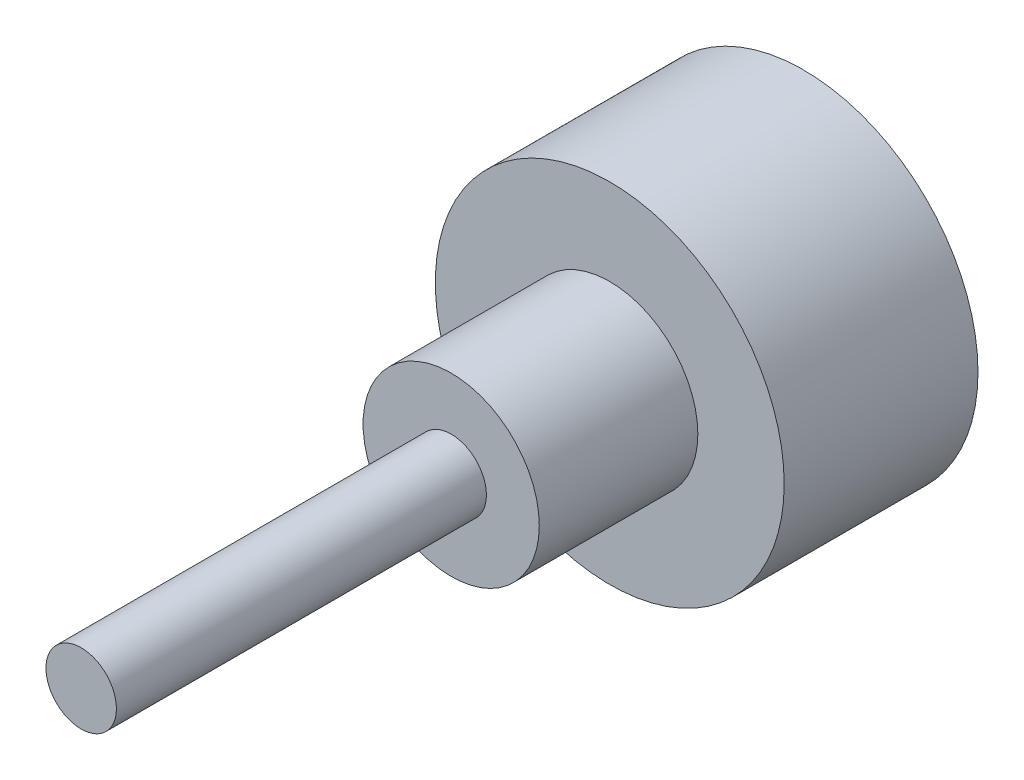
ISO-10303-21;
HEADER;
FILE_DESCRIPTION(('STEP AP214'),'2;1');
FILE_NAME('part.step','',(''),(''),'','','');
FILE_SCHEMA(('AUTOMOTIVE_DESIGN { 1 0 10303 214 1 1 1 1 }'));
ENDSEC;
DATA;
#1=APPLICATION_CONTEXT('core data for automotive mechanical design processes');
#2=APPLICATION_PROTOCOL_DEFINITION('international standard','automotive_design',2000,#1);
#3=PRODUCT_CONTEXT('',#1,'mechanical');
#4=PRODUCT('Part','Part','',(#3));
#5=PRODUCT_RELATED_PRODUCT_CATEGORY('part','',(#4));
#6=PRODUCT_DEFINITION_FORMATION('','',#4);
#7=PRODUCT_DEFINITION_CONTEXT('part definition',#1,'design');
#8=PRODUCT_DEFINITION('design','',#6,#7);
#9=PRODUCT_DEFINITION_SHAPE('','',#8);
#10=(LENGTH_UNIT() NAMED_UNIT(*) SI_UNIT(.MILLI.,.METRE.));
#11=(NAMED_UNIT(*) PLANE_ANGLE_UNIT() SI_UNIT($,.RADIAN.));
#12=(NAMED_UNIT(*) SI_UNIT($,.STERADIAN.) SOLID_ANGLE_UNIT());
#13=UNCERTAINTY_MEASURE_WITH_UNIT(LENGTH_MEASURE(1.E-05),#10,'distance_accuracy_value','');
#14=(GEOMETRIC_REPRESENTATION_CONTEXT(3) GLOBAL_UNCERTAINTY_ASSIGNED_CONTEXT((#13)) GLOBAL_UNIT_ASSIGNED_CONTEXT((#10,
#11,#12)) REPRESENTATION_CONTEXT('',''));
#15=CARTESIAN_POINT('',(0.,0.,0.));
#16=DIRECTION('',(0.,0.,1.));
#17=DIRECTION('',(1.,0.,0.));
#18=AXIS2_PLACEMENT_3D('',#15,#16,#17);
#19=CARTESIAN_POINT('',(0.,0.,0.));
#20=DIRECTION('',(0.,0.,1.));
#21=DIRECTION('',(1.,0.,0.));
#22=AXIS2_PLACEMENT_3D('',#19,#20,#21);
#23=PLANE('',#22);
#24=CARTESIAN_POINT('',(0.,0.,0.));
#25=DIRECTION('',(0.,0.,1.));
#26=DIRECTION('',(1.,0.,0.));
#27=AXIS2_PLACEMENT_3D('',#24,#25,#26);
#28=CIRCLE('',#27,9.9);
#29=CARTESIAN_POINT('',(9.9,0.,0.));
#30=VERTEX_POINT('',#29);
#31=EDGE_CURVE('E10',#30,#30,#28,.T.);
#32=ORIENTED_EDGE('',*,*,#31,.F.);
#33=EDGE_LOOP('',(#32));
#34=FACE_BOUND('',#33,.T.);
#35=CARTESIAN_POINT('',(0.,0.,0.));
#36=DIRECTION('',(0.,0.,1.));
#37=DIRECTION('',(1.,0.,0.));
#38=AXIS2_PLACEMENT_3D('',#35,#36,#37);
#39=CIRCLE('',#38,7.9);
#40=CARTESIAN_POINT('',(7.9,0.,0.));
#41=VERTEX_POINT('',#40);
#42=EDGE_CURVE('E39',#41,#41,#39,.T.);
#43=ORIENTED_EDGE('',*,*,#42,.T.);
#44=EDGE_LOOP('',(#43));
#45=FACE_BOUND('',#44,.T.);
#46=ADVANCED_FACE('F31',(#34,#45),#23,.F.);
#47=CARTESIAN_POINT('',(0.,0.,10.));
#48=DIRECTION('',(0.,0.,-1.));
#49=DIRECTION('',(-1.,0.,0.));
#50=AXIS2_PLACEMENT_3D('',#47,#48,#49);
#51=CYLINDRICAL_SURFACE('',#50,9.9);
#52=ORIENTED_EDGE('',*,*,#31,.T.);
#53=EDGE_LOOP('',(#52));
#54=FACE_BOUND('',#53,.T.);
#55=CARTESIAN_POINT('',(0.,0.,11.));
#56=DIRECTION('',(0.,0.,1.));
#57=DIRECTION('',(1.,0.,0.));
#58=AXIS2_PLACEMENT_3D('',#55,#56,#57);
#59=CIRCLE('',#58,9.9);
#60=CARTESIAN_POINT('',(9.9,0.,11.));
#61=VERTEX_POINT('',#60);
#62=EDGE_CURVE('E48',#61,#61,#59,.T.);
#63=ORIENTED_EDGE('',*,*,#62,.F.);
#64=EDGE_LOOP('',(#63));
#65=FACE_BOUND('',#64,.T.);
#66=ADVANCED_FACE('F33',(#54,#65),#51,.T.);
#67=CARTESIAN_POINT('',(0.,0.,10.));
#68=DIRECTION('',(0.,0.,-1.));
#69=DIRECTION('',(-1.,0.,0.));
#70=AXIS2_PLACEMENT_3D('',#67,#68,#69);
#71=CYLINDRICAL_SURFACE('',#70,7.9);
#72=CARTESIAN_POINT('',(0.,0.,10.));
#73=DIRECTION('',(0.,0.,1.));
#74=DIRECTION('',(1.,0.,0.));
#75=AXIS2_PLACEMENT_3D('',#72,#73,#74);
#76=CIRCLE('',#75,7.9);
#77=CARTESIAN_POINT('',(7.9,0.,10.));
#78=VERTEX_POINT('',#77);
#79=EDGE_CURVE('E43',#78,#78,#76,.T.);
#80=ORIENTED_EDGE('',*,*,#79,.T.);
#81=EDGE_LOOP('',(#80));
#82=FACE_BOUND('',#81,.T.);
#83=ORIENTED_EDGE('',*,*,#42,.F.);
#84=EDGE_LOOP('',(#83));
#85=FACE_BOUND('',#84,.T.);
#86=ADVANCED_FACE('F84',(#82,#85),#71,.F.);
#87=CARTESIAN_POINT('',(0.,0.,10.));
#88=DIRECTION('',(0.,0.,1.));
#89=DIRECTION('',(1.,0.,0.));
#90=AXIS2_PLACEMENT_3D('',#87,#88,#89);
#91=PLANE('',#90);
#92=ORIENTED_EDGE('',*,*,#79,.F.);
#93=EDGE_LOOP('',(#92));
#94=FACE_BOUND('',#93,.T.);
#95=ADVANCED_FACE('F89',(#94),#91,.F.);
#96=CARTESIAN_POINT('',(0.,0.,11.));
#97=DIRECTION('',(0.,0.,1.));
#98=DIRECTION('',(1.,0.,0.));
#99=AXIS2_PLACEMENT_3D('',#96,#97,#98);
#100=PLANE('',#99);
#101=CARTESIAN_POINT('',(0.,0.,11.));
#102=DIRECTION('',(0.,0.,1.));
#103=DIRECTION('',(1.,0.,0.));
#104=AXIS2_PLACEMENT_3D('',#101,#102,#103);
#105=CIRCLE('',#104,5.);
#106=CARTESIAN_POINT('',(5.,0.,11.));
#107=VERTEX_POINT('',#106);
#108=EDGE_CURVE('E52',#107,#107,#105,.T.);
#109=ORIENTED_EDGE('',*,*,#108,.F.);
#110=EDGE_LOOP('',(#109));
#111=FACE_BOUND('',#110,.T.);
#112=ORIENTED_EDGE('',*,*,#62,.T.);
#113=EDGE_LOOP('',(#112));
#114=FACE_BOUND('',#113,.T.);
#115=ADVANCED_FACE('F93',(#111,#114),#100,.T.);
#116=CARTESIAN_POINT('',(0.,0.,20.));
#117=DIRECTION('',(0.,0.,-1.));
#118=DIRECTION('',(-1.,0.,0.));
#119=AXIS2_PLACEMENT_3D('',#116,#117,#118);
#120=CYLINDRICAL_SURFACE('',#119,5.);
#121=CARTESIAN_POINT('',(0.,0.,20.));
#122=DIRECTION('',(0.,0.,1.));
#123=DIRECTION('',(1.,0.,0.));
#124=AXIS2_PLACEMENT_3D('',#121,#122,#123);
#125=CIRCLE('',#124,5.);
#126=CARTESIAN_POINT('',(5.,0.,20.));
#127=VERTEX_POINT('',#126);
#128=EDGE_CURVE('E51',#127,#127,#125,.T.);
#129=ORIENTED_EDGE('',*,*,#128,.F.);
#130=EDGE_LOOP('',(#129));
#131=FACE_BOUND('',#130,.T.);
#132=ORIENTED_EDGE('',*,*,#108,.T.);
#133=EDGE_LOOP('',(#132));
#134=FACE_BOUND('',#133,.T.);
#135=ADVANCED_FACE('F77',(#131,#134),#120,.T.);
#136=CARTESIAN_POINT('',(0.,0.,20.));
#137=DIRECTION('',(0.,0.,1.));
#138=DIRECTION('',(1.,0.,0.));
#139=AXIS2_PLACEMENT_3D('',#136,#137,#138);
#140=PLANE('',#139);
#141=CARTESIAN_POINT('',(0.,0.,20.));
#142=DIRECTION('',(0.,0.,1.));
#143=DIRECTION('',(1.,0.,0.));
#144=AXIS2_PLACEMENT_3D('',#141,#142,#143);
#145=CIRCLE('',#144,2.);
#146=CARTESIAN_POINT('',(2.,0.,20.));
#147=VERTEX_POINT('',#146);
#148=EDGE_CURVE('E35',#147,#147,#145,.F.);
#149=ORIENTED_EDGE('',*,*,#148,.T.);
#150=EDGE_LOOP('',(#149));
#151=FACE_BOUND('',#150,.T.);
#152=ORIENTED_EDGE('',*,*,#128,.T.);
#153=EDGE_LOOP('',(#152));
#154=FACE_BOUND('',#153,.T.);
#155=ADVANCED_FACE('F64',(#151,#154),#140,.T.);
#156=CARTESIAN_POINT('',(0.,0.,41.));
#157=DIRECTION('',(0.,0.,-1.));
#158=DIRECTION('',(-1.,0.,0.));
#159=AXIS2_PLACEMENT_3D('',#156,#157,#158);
#160=CYLINDRICAL_SURFACE('',#159,2.);
#161=ORIENTED_EDGE('',*,*,#148,.F.);
#162=EDGE_LOOP('',(#161));
#163=FACE_BOUND('',#162,.T.);
#164=CARTESIAN_POINT('',(0.,0.,41.));
#165=DIRECTION('',(0.,0.,1.));
#166=DIRECTION('',(1.,0.,0.));
#167=AXIS2_PLACEMENT_3D('',#164,#165,#166);
#168=CIRCLE('',#167,2.);
#169=CARTESIAN_POINT('',(2.,0.,41.));
#170=VERTEX_POINT('',#169);
#171=EDGE_CURVE('E57',#170,#170,#168,.T.);
#172=ORIENTED_EDGE('',*,*,#171,.F.);
#173=EDGE_LOOP('',(#172));
#174=FACE_BOUND('',#173,.T.);
#175=ADVANCED_FACE('F67',(#163,#174),#160,.T.);
#176=CARTESIAN_POINT('',(0.,0.,41.));
#177=DIRECTION('',(0.,0.,1.));
#178=DIRECTION('',(1.,0.,0.));
#179=AXIS2_PLACEMENT_3D('',#176,#177,#178);
#180=PLANE('',#179);
#181=ORIENTED_EDGE('',*,*,#171,.T.);
#182=EDGE_LOOP('',(#181));
#183=FACE_BOUND('',#182,.T.);
#184=ADVANCED_FACE('F70',(#183),#180,.T.);
#185=CLOSED_SHELL('',(#46,#66,#86,#95,#115,#135,#155,#175,#184));
#186=MANIFOLD_SOLID_BREP('B2',#185);
#187=ADVANCED_BREP_SHAPE_REPRESENTATION('',(#18,#186),#14);
#188=SHAPE_DEFINITION_REPRESENTATION(#9,#187);
ENDSEC;
END-ISO-10303-21;
